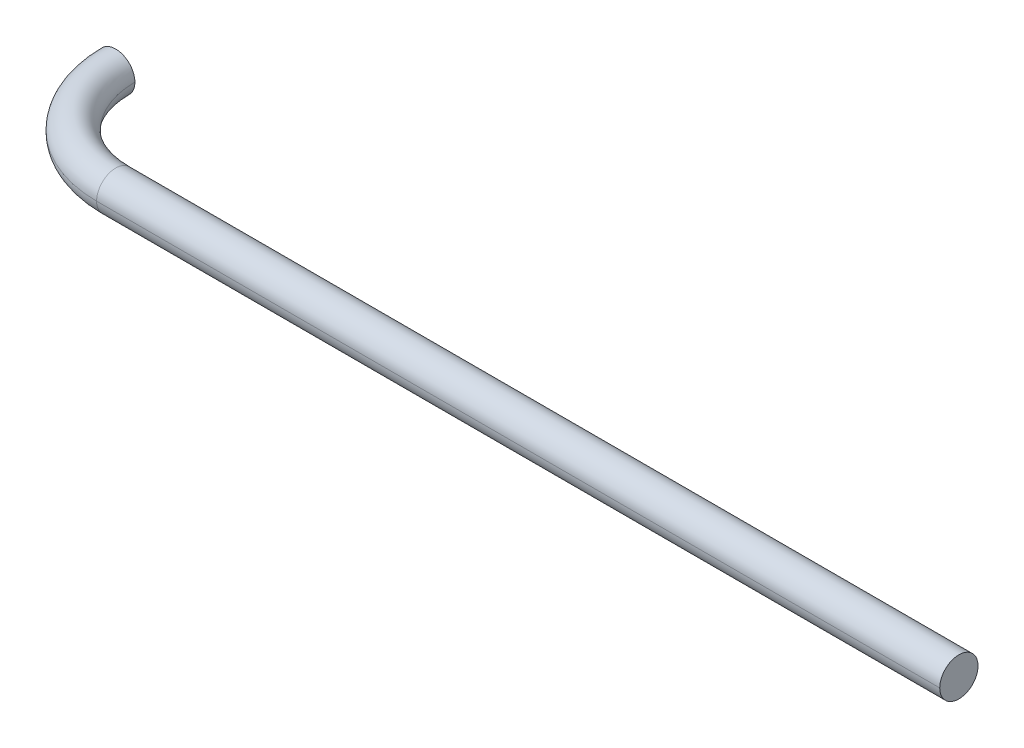
ISO-10303-21;
HEADER;
FILE_DESCRIPTION(('STEP AP214'),'2;1');
FILE_NAME('part.step','',(''),(''),'','','');
FILE_SCHEMA(('AUTOMOTIVE_DESIGN { 1 0 10303 214 1 1 1 1 }'));
ENDSEC;
DATA;
#1=APPLICATION_CONTEXT('core data for automotive mechanical design processes');
#2=APPLICATION_PROTOCOL_DEFINITION('international standard','automotive_design',2000,#1);
#3=PRODUCT_CONTEXT('',#1,'mechanical');
#4=PRODUCT('Part','Part','',(#3));
#5=PRODUCT_RELATED_PRODUCT_CATEGORY('part','',(#4));
#6=PRODUCT_DEFINITION_FORMATION('','',#4);
#7=PRODUCT_DEFINITION_CONTEXT('part definition',#1,'design');
#8=PRODUCT_DEFINITION('design','',#6,#7);
#9=PRODUCT_DEFINITION_SHAPE('','',#8);
#10=(LENGTH_UNIT() NAMED_UNIT(*) SI_UNIT(.MILLI.,.METRE.));
#11=(NAMED_UNIT(*) PLANE_ANGLE_UNIT() SI_UNIT($,.RADIAN.));
#12=(NAMED_UNIT(*) SI_UNIT($,.STERADIAN.) SOLID_ANGLE_UNIT());
#13=UNCERTAINTY_MEASURE_WITH_UNIT(LENGTH_MEASURE(1.E-05),#10,'distance_accuracy_value','');
#14=(GEOMETRIC_REPRESENTATION_CONTEXT(3) GLOBAL_UNCERTAINTY_ASSIGNED_CONTEXT((#13)) GLOBAL_UNIT_ASSIGNED_CONTEXT((#10,
#11,#12)) REPRESENTATION_CONTEXT('',''));
#15=CARTESIAN_POINT('',(0.,0.,0.));
#16=DIRECTION('',(0.,0.,1.));
#17=DIRECTION('',(1.,0.,0.));
#18=AXIS2_PLACEMENT_3D('',#15,#16,#17);
#19=CARTESIAN_POINT('',(3.4999999999986,0.,1.39727442019107E-12));
#20=DIRECTION('',(0.,1.,0.));
#21=DIRECTION('',(-1.,0.,-3.99221262911893E-13));
#22=AXIS2_PLACEMENT_3D('',#19,#20,#21);
#23=TOROIDAL_SURFACE('',#22,3.4999999999986,0.65);
#24=CARTESIAN_POINT('',(3.4999999999986,0.,1.39727442019107E-12));
#25=DIRECTION('',(0.,1.,0.));
#26=DIRECTION('',(0.,0.,1.));
#27=AXIS2_PLACEMENT_3D('',#24,#25,#26);
#28=CIRCLE('',#27,4.1499999999986);
#29=CARTESIAN_POINT('',(-0.65,0.,0.));
#30=VERTEX_POINT('',#29);
#31=CARTESIAN_POINT('',(3.49999999999748,0.,4.15));
#32=VERTEX_POINT('',#31);
#33=EDGE_CURVE('E87',#30,#32,#28,.T.);
#34=ORIENTED_EDGE('',*,*,#33,.F.);
#35=CARTESIAN_POINT('',(0.,0.,0.));
#36=DIRECTION('',(0.,0.,1.));
#37=DIRECTION('',(-1.,0.,0.));
#38=AXIS2_PLACEMENT_3D('',#35,#36,#37);
#39=CIRCLE('',#38,0.65);
#40=CARTESIAN_POINT('',(0.65,0.,0.));
#41=VERTEX_POINT('',#40);
#42=EDGE_CURVE('E27',#30,#41,#39,.T.);
#43=ORIENTED_EDGE('',*,*,#42,.T.);
#44=CARTESIAN_POINT('',(3.4999999999986,0.,1.39727442019107E-12));
#45=DIRECTION('',(0.,1.,0.));
#46=DIRECTION('',(0.,0.,1.));
#47=AXIS2_PLACEMENT_3D('',#44,#45,#46);
#48=CIRCLE('',#47,2.8499999999986);
#49=CARTESIAN_POINT('',(3.49999999999783,0.,2.85));
#50=VERTEX_POINT('',#49);
#51=EDGE_CURVE('E77',#41,#50,#48,.T.);
#52=ORIENTED_EDGE('',*,*,#51,.T.);
#53=CARTESIAN_POINT('',(3.49999999999765,0.,3.5));
#54=DIRECTION('',(1.,0.,2.71550944124062E-13));
#55=DIRECTION('',(-2.71550944124062E-13,0.,1.));
#56=AXIS2_PLACEMENT_3D('',#53,#54,#55);
#57=CIRCLE('',#56,0.65);
#58=EDGE_CURVE('E71',#32,#50,#57,.T.);
#59=ORIENTED_EDGE('',*,*,#58,.F.);
#60=EDGE_LOOP('',(#34,#43,#52,#59));
#61=FACE_BOUND('',#60,.T.);
#62=ADVANCED_FACE('F17',(#61),#23,.T.);
#63=CARTESIAN_POINT('',(3.49999999999765,0.,3.5));
#64=DIRECTION('',(1.,0.,0.));
#65=DIRECTION('',(0.,0.,1.));
#66=AXIS2_PLACEMENT_3D('',#63,#64,#65);
#67=CYLINDRICAL_SURFACE('',#66,0.65);
#68=DIRECTION('',(1.,0.,0.));
#69=VECTOR('',#68,1.);
#70=CARTESIAN_POINT('',(3.49999999999765,0.,2.85));
#71=LINE('',#70,#69);
#72=CARTESIAN_POINT('',(32.1389851691479,0.,2.85));
#73=VERTEX_POINT('',#72);
#74=EDGE_CURVE('E20',#50,#73,#71,.T.);
#75=ORIENTED_EDGE('',*,*,#74,.F.);
#76=CARTESIAN_POINT('',(3.49999999999765,0.,3.5));
#77=DIRECTION('',(1.,0.,2.71550944124062E-13));
#78=DIRECTION('',(-2.71550944124062E-13,0.,1.));
#79=AXIS2_PLACEMENT_3D('',#76,#77,#78);
#80=CIRCLE('',#79,0.65);
#81=EDGE_CURVE('E67',#50,#32,#80,.T.);
#82=ORIENTED_EDGE('',*,*,#81,.T.);
#83=DIRECTION('',(1.,0.,0.));
#84=VECTOR('',#83,1.);
#85=CARTESIAN_POINT('',(3.49999999999765,0.,4.15));
#86=LINE('',#85,#84);
#87=CARTESIAN_POINT('',(32.1389851691481,0.,4.15));
#88=VERTEX_POINT('',#87);
#89=EDGE_CURVE('E56',#32,#88,#86,.T.);
#90=ORIENTED_EDGE('',*,*,#89,.T.);
#91=CARTESIAN_POINT('',(32.138985169148,0.,3.5));
#92=DIRECTION('',(1.,0.,-1.28102656687518E-13));
#93=DIRECTION('',(1.28102656687518E-13,0.,1.));
#94=AXIS2_PLACEMENT_3D('',#91,#92,#93);
#95=CIRCLE('',#94,0.65);
#96=EDGE_CURVE('E11',#73,#88,#95,.T.);
#97=ORIENTED_EDGE('',*,*,#96,.F.);
#98=EDGE_LOOP('',(#75,#82,#90,#97));
#99=FACE_BOUND('',#98,.T.);
#100=ADVANCED_FACE('F65',(#99),#67,.T.);
#101=CARTESIAN_POINT('',(32.138985169148,0.,3.5));
#102=DIRECTION('',(1.,0.,-1.27491950812021E-13));
#103=DIRECTION('',(-1.27491950812021E-13,0.,-1.));
#104=AXIS2_PLACEMENT_3D('',#101,#102,#103);
#105=PLANE('',#104);
#106=CARTESIAN_POINT('',(32.138985169148,0.,3.5));
#107=DIRECTION('',(1.,0.,-1.28102656687518E-13));
#108=DIRECTION('',(1.28102656687518E-13,0.,1.));
#109=AXIS2_PLACEMENT_3D('',#106,#107,#108);
#110=CIRCLE('',#109,0.65);
#111=EDGE_CURVE('E70',#88,#73,#110,.T.);
#112=ORIENTED_EDGE('',*,*,#111,.T.);
#113=ORIENTED_EDGE('',*,*,#96,.T.);
#114=EDGE_LOOP('',(#112,#113));
#115=FACE_BOUND('',#114,.T.);
#116=ADVANCED_FACE('F137',(#115),#105,.T.);
#117=CARTESIAN_POINT('',(0.,0.,0.));
#118=DIRECTION('',(0.,0.,1.));
#119=DIRECTION('',(1.,0.,0.));
#120=AXIS2_PLACEMENT_3D('',#117,#118,#119);
#121=PLANE('',#120);
#122=CARTESIAN_POINT('',(0.,0.,0.));
#123=DIRECTION('',(0.,0.,1.));
#124=DIRECTION('',(-1.,0.,0.));
#125=AXIS2_PLACEMENT_3D('',#122,#123,#124);
#126=CIRCLE('',#125,0.65);
#127=EDGE_CURVE('E94',#41,#30,#126,.T.);
#128=ORIENTED_EDGE('',*,*,#127,.F.);
#129=ORIENTED_EDGE('',*,*,#42,.F.);
#130=EDGE_LOOP('',(#128,#129));
#131=FACE_BOUND('',#130,.T.);
#132=ADVANCED_FACE('F106',(#131),#121,.F.);
#133=CARTESIAN_POINT('',(3.49999999999765,0.,3.5));
#134=DIRECTION('',(1.,0.,0.));
#135=DIRECTION('',(0.,0.,1.));
#136=AXIS2_PLACEMENT_3D('',#133,#134,#135);
#137=CYLINDRICAL_SURFACE('',#136,0.65);
#138=ORIENTED_EDGE('',*,*,#58,.T.);
#139=ORIENTED_EDGE('',*,*,#74,.T.);
#140=ORIENTED_EDGE('',*,*,#111,.F.);
#141=ORIENTED_EDGE('',*,*,#89,.F.);
#142=EDGE_LOOP('',(#138,#139,#140,#141));
#143=FACE_BOUND('',#142,.T.);
#144=ADVANCED_FACE('F73',(#143),#137,.T.);
#145=CARTESIAN_POINT('',(3.4999999999986,0.,1.39727442019107E-12));
#146=DIRECTION('',(0.,1.,0.));
#147=DIRECTION('',(-1.,0.,-3.99221262911893E-13));
#148=AXIS2_PLACEMENT_3D('',#145,#146,#147);
#149=TOROIDAL_SURFACE('',#148,3.4999999999986,0.65);
#150=ORIENTED_EDGE('',*,*,#127,.T.);
#151=ORIENTED_EDGE('',*,*,#33,.T.);
#152=ORIENTED_EDGE('',*,*,#81,.F.);
#153=ORIENTED_EDGE('',*,*,#51,.F.);
#154=EDGE_LOOP('',(#150,#151,#152,#153));
#155=FACE_BOUND('',#154,.T.);
#156=ADVANCED_FACE('F86',(#155),#149,.T.);
#157=CLOSED_SHELL('',(#62,#100,#116,#132,#144,#156));
#158=MANIFOLD_SOLID_BREP('B1',#157);
#159=ADVANCED_BREP_SHAPE_REPRESENTATION('',(#18,#158),#14);
#160=SHAPE_DEFINITION_REPRESENTATION(#9,#159);
ENDSEC;
END-ISO-10303-21;
